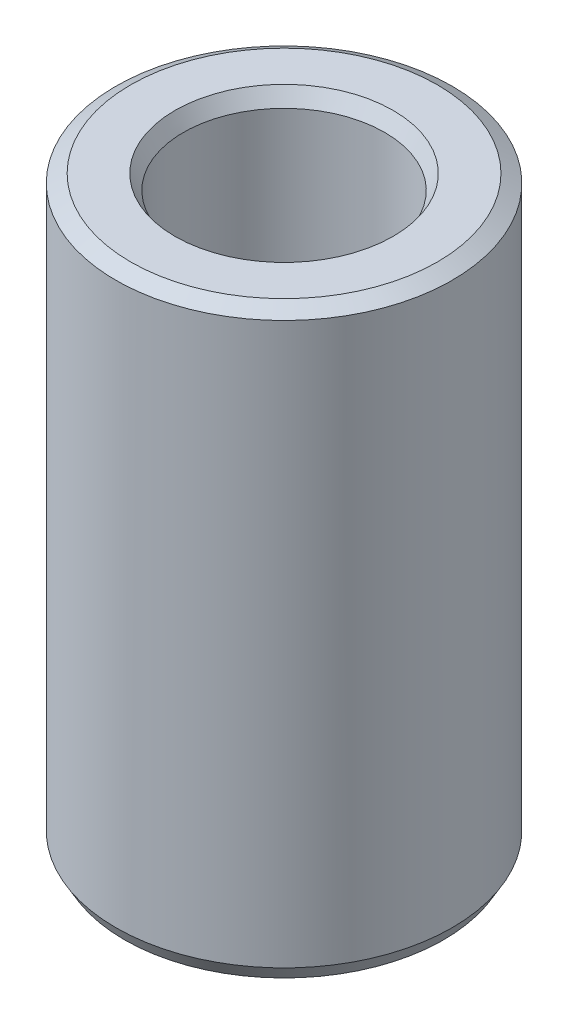
ISO-10303-21;
HEADER;
FILE_DESCRIPTION(('STEP AP214'),'2;1');
FILE_NAME('part.step','',(''),(''),'','','');
FILE_SCHEMA(('AUTOMOTIVE_DESIGN { 1 0 10303 214 1 1 1 1 }'));
ENDSEC;
DATA;
#1=APPLICATION_CONTEXT('core data for automotive mechanical design processes');
#2=APPLICATION_PROTOCOL_DEFINITION('international standard','automotive_design',2000,#1);
#3=PRODUCT_CONTEXT('',#1,'mechanical');
#4=PRODUCT('Part','Part','',(#3));
#5=PRODUCT_RELATED_PRODUCT_CATEGORY('part','',(#4));
#6=PRODUCT_DEFINITION_FORMATION('','',#4);
#7=PRODUCT_DEFINITION_CONTEXT('part definition',#1,'design');
#8=PRODUCT_DEFINITION('design','',#6,#7);
#9=PRODUCT_DEFINITION_SHAPE('','',#8);
#10=(LENGTH_UNIT() NAMED_UNIT(*) SI_UNIT(.MILLI.,.METRE.));
#11=(NAMED_UNIT(*) PLANE_ANGLE_UNIT() SI_UNIT($,.RADIAN.));
#12=(NAMED_UNIT(*) SI_UNIT($,.STERADIAN.) SOLID_ANGLE_UNIT());
#13=UNCERTAINTY_MEASURE_WITH_UNIT(LENGTH_MEASURE(1.E-05),#10,'distance_accuracy_value','');
#14=(GEOMETRIC_REPRESENTATION_CONTEXT(3) GLOBAL_UNCERTAINTY_ASSIGNED_CONTEXT((#13)) GLOBAL_UNIT_ASSIGNED_CONTEXT((#10,
#11,#12)) REPRESENTATION_CONTEXT('',''));
#15=CARTESIAN_POINT('',(0.,0.,0.));
#16=DIRECTION('',(0.,0.,1.));
#17=DIRECTION('',(1.,0.,0.));
#18=AXIS2_PLACEMENT_3D('',#15,#16,#17);
#19=CARTESIAN_POINT('',(0.,182.316415809923,0.));
#20=DIRECTION('',(0.,-1.,0.));
#21=DIRECTION('',(0.,0.,-1.));
#22=AXIS2_PLACEMENT_3D('',#19,#20,#21);
#23=CYLINDRICAL_SURFACE('',#22,52.5);
#24=CARTESIAN_POINT('',(0.,4.60658287398247,0.));
#25=DIRECTION('',(0.,1.,0.));
#26=DIRECTION('',(0.,0.,1.));
#27=AXIS2_PLACEMENT_3D('',#24,#25,#26);
#28=CIRCLE('',#27,52.5);
#29=CARTESIAN_POINT('',(0.,4.60658287398247,-52.5));
#30=VERTEX_POINT('',#29);
#31=EDGE_CURVE('E10',#30,#30,#28,.T.);
#32=CARTESIAN_POINT('',(0.,179.656803947585,0.));
#33=DIRECTION('',(0.,1.,0.));
#34=DIRECTION('',(0.,0.,1.));
#35=AXIS2_PLACEMENT_3D('',#32,#33,#34);
#36=CIRCLE('',#35,52.5);
#37=CARTESIAN_POINT('',(0.,179.656803947585,-52.5));
#38=VERTEX_POINT('',#37);
#39=EDGE_CURVE('E50',#38,#38,#36,.F.);
#40=CARTESIAN_POINT('',(0.,4.60658287398247,-52.5));
#41=CARTESIAN_POINT('',(0.,6.4300226768325,-52.5));
#42=CARTESIAN_POINT('',(0.,8.25346247968252,-52.5));
#43=CARTESIAN_POINT('',(0.,11.9003420853826,-52.5));
#44=CARTESIAN_POINT('',(0.,13.7237818882326,-52.5));
#45=CARTESIAN_POINT('',(0.,17.3706614939327,-52.5));
#46=CARTESIAN_POINT('',(0.,19.1941012967827,-52.5));
#47=CARTESIAN_POINT('',(0.,22.8409809024827,-52.5));
#48=CARTESIAN_POINT('',(0.,24.6644207053327,-52.5));
#49=CARTESIAN_POINT('',(0.,28.3113003110328,-52.5));
#50=CARTESIAN_POINT('',(0.,30.1347401138828,-52.5));
#51=CARTESIAN_POINT('',(0.,33.7816197195829,-52.5));
#52=CARTESIAN_POINT('',(0.,35.6050595224329,-52.5));
#53=CARTESIAN_POINT('',(0.,39.2519391281329,-52.5));
#54=CARTESIAN_POINT('',(0.,41.075378930983,-52.5));
#55=CARTESIAN_POINT('',(0.,44.722258536683,-52.5));
#56=CARTESIAN_POINT('',(0.,46.5456983395331,-52.5));
#57=CARTESIAN_POINT('',(0.,50.1925779452331,-52.5));
#58=CARTESIAN_POINT('',(0.,52.0160177480831,-52.5));
#59=CARTESIAN_POINT('',(0.,55.6628973537832,-52.5));
#60=CARTESIAN_POINT('',(0.,57.4863371566332,-52.5));
#61=CARTESIAN_POINT('',(0.,61.1332167623332,-52.5));
#62=CARTESIAN_POINT('',(0.,62.9566565651833,-52.5));
#63=CARTESIAN_POINT('',(0.,66.6035361708833,-52.5));
#64=CARTESIAN_POINT('',(0.,68.4269759737333,-52.5));
#65=CARTESIAN_POINT('',(0.,72.0738555794334,-52.5));
#66=CARTESIAN_POINT('',(0.,73.8972953822834,-52.5));
#67=CARTESIAN_POINT('',(0.,77.5441749879835,-52.5));
#68=CARTESIAN_POINT('',(0.,79.3676147908335,-52.5));
#69=CARTESIAN_POINT('',(0.,83.0144943965336,-52.5));
#70=CARTESIAN_POINT('',(0.,84.8379341993836,-52.5));
#71=CARTESIAN_POINT('',(0.,88.4848138050836,-52.5));
#72=CARTESIAN_POINT('',(0.,90.3082536079337,-52.5));
#73=CARTESIAN_POINT('',(0.,93.9551332136337,-52.5));
#74=CARTESIAN_POINT('',(0.,95.7785730164837,-52.5));
#75=CARTESIAN_POINT('',(0.,99.4254526221838,-52.5));
#76=CARTESIAN_POINT('',(0.,101.248892425034,-52.5));
#77=CARTESIAN_POINT('',(0.,104.895772030734,-52.5));
#78=CARTESIAN_POINT('',(0.,106.719211833584,-52.5));
#79=CARTESIAN_POINT('',(0.,110.366091439284,-52.5));
#80=CARTESIAN_POINT('',(0.,112.189531242134,-52.5));
#81=CARTESIAN_POINT('',(0.,115.836410847834,-52.5));
#82=CARTESIAN_POINT('',(0.,117.659850650684,-52.5));
#83=CARTESIAN_POINT('',(0.,121.306730256384,-52.5));
#84=CARTESIAN_POINT('',(0.,123.130170059234,-52.5));
#85=CARTESIAN_POINT('',(0.,126.777049664934,-52.5));
#86=CARTESIAN_POINT('',(0.,128.600489467784,-52.5));
#87=CARTESIAN_POINT('',(0.,132.247369073484,-52.5));
#88=CARTESIAN_POINT('',(0.,134.070808876334,-52.5));
#89=CARTESIAN_POINT('',(0.,137.717688482034,-52.5));
#90=CARTESIAN_POINT('',(0.,139.541128284884,-52.5));
#91=CARTESIAN_POINT('',(0.,143.188007890584,-52.5));
#92=CARTESIAN_POINT('',(0.,145.011447693434,-52.5));
#93=CARTESIAN_POINT('',(0.,148.658327299134,-52.5));
#94=CARTESIAN_POINT('',(0.,150.481767101985,-52.5));
#95=CARTESIAN_POINT('',(0.,154.128646707685,-52.5));
#96=CARTESIAN_POINT('',(0.,155.952086510535,-52.5));
#97=CARTESIAN_POINT('',(0.,159.598966116235,-52.5));
#98=CARTESIAN_POINT('',(0.,161.422405919085,-52.5));
#99=CARTESIAN_POINT('',(0.,165.069285524785,-52.5));
#100=CARTESIAN_POINT('',(0.,166.892725327635,-52.5));
#101=CARTESIAN_POINT('',(0.,170.539604933335,-52.5));
#102=CARTESIAN_POINT('',(0.,172.363044736185,-52.5));
#103=CARTESIAN_POINT('',(0.,176.009924341885,-52.5));
#104=CARTESIAN_POINT('',(0.,177.833364144735,-52.5));
#105=CARTESIAN_POINT('',(0.,179.656803947585,-52.5));
#106=B_SPLINE_CURVE_WITH_KNOTS('',3,(#40,#41,#42,#43,#44,#45,#46,#47,#48,#49,#50,#51,#52,#53,
#54,#55,#56,#57,#58,#59,#60,#61,#62,#63,#64,#65,#66,#67,#68,#69,#70,#71,#72,#73,#74,#75,#76,#77,
#78,#79,#80,#81,#82,#83,#84,#85,#86,#87,#88,#89,#90,#91,#92,#93,#94,#95,#96,#97,#98,#99,#100,
#101,#102,#103,#104,#105),.UNSPECIFIED.,.F.,.F.,(4,2,2,2,2,2,2,2,2,2,2,2,2,2,2,2,2,2,2,2,2,2,2,
2,2,2,2,2,2,2,2,2,4),(0.,5.47031940855008,10.9406388171002,16.4109582256502,21.8812776342003,
27.3515970427504,32.8219164513004,38.2922358598505,43.7625552684006,49.2328746769507,
54.7031940855008,60.1735134940508,65.6438329026009,71.114152311151,76.5844717197011,
82.0547911282511,87.5251105368012,92.9954299453513,98.4657493539014,103.936068762451,
109.406388171002,114.876707579552,120.347026988102,125.817346396652,131.287665805202,
136.757985213752,142.228304622302,147.698624030852,153.168943439402,158.639262847952,
164.109582256502,169.579901665052,175.050221073602),.UNSPECIFIED.);
#107=EDGE_CURVE('BSEAM39',#30,#38,#106,.T.);
#108=ORIENTED_EDGE('',*,*,#31,.T.);
#109=ORIENTED_EDGE('',*,*,#39,.T.);
#110=ORIENTED_EDGE('',*,*,#107,.T.);
#111=ORIENTED_EDGE('',*,*,#107,.F.);
#112=EDGE_LOOP('',(#108,#110,#109,#111));
#113=FACE_BOUND('',#112,.T.);
#114=ADVANCED_FACE('F39',(#113),#23,.T.);
#115=CARTESIAN_POINT('',(0.,182.316415809923,0.));
#116=DIRECTION('',(0.,1.,0.));
#117=DIRECTION('',(0.,0.,1.));
#118=AXIS2_PLACEMENT_3D('',#115,#116,#117);
#119=PLANE('',#118);
#120=CARTESIAN_POINT('',(0.,182.316415809923,0.));
#121=DIRECTION('',(0.,1.,0.));
#122=DIRECTION('',(0.,0.,1.));
#123=AXIS2_PLACEMENT_3D('',#120,#121,#122);
#124=CIRCLE('',#123,34.0677595680798);
#125=CARTESIAN_POINT('',(0.,182.316415809923,34.0677595680798));
#126=VERTEX_POINT('',#125);
#127=EDGE_CURVE('E58',#126,#126,#124,.F.);
#128=ORIENTED_EDGE('',*,*,#127,.T.);
#129=EDGE_LOOP('',(#128));
#130=FACE_BOUND('',#129,.T.);
#131=CARTESIAN_POINT('',(0.,182.316415809923,0.));
#132=DIRECTION('',(0.,1.,0.));
#133=DIRECTION('',(0.,0.,1.));
#134=AXIS2_PLACEMENT_3D('',#131,#132,#133);
#135=CIRCLE('',#134,47.8934171260181);
#136=CARTESIAN_POINT('',(0.,182.316415809923,47.8934171260181));
#137=VERTEX_POINT('',#136);
#138=EDGE_CURVE('E61',#137,#137,#135,.T.);
#139=ORIENTED_EDGE('',*,*,#138,.T.);
#140=EDGE_LOOP('',(#139));
#141=FACE_BOUND('',#140,.T.);
#142=ADVANCED_FACE('F88',(#130,#141),#119,.T.);
#143=CARTESIAN_POINT('',(0.,0.,0.));
#144=DIRECTION('',(0.,1.,0.));
#145=DIRECTION('',(0.,0.,1.));
#146=AXIS2_PLACEMENT_3D('',#143,#144,#145);
#147=PLANE('',#146);
#148=CARTESIAN_POINT('',(0.,0.,0.));
#149=DIRECTION('',(0.,1.,0.));
#150=DIRECTION('',(0.,0.,1.));
#151=AXIS2_PLACEMENT_3D('',#148,#149,#150);
#152=CIRCLE('',#151,36.0147305797238);
#153=CARTESIAN_POINT('',(0.,0.,36.0147305797238));
#154=VERTEX_POINT('',#153);
#155=EDGE_CURVE('E51',#154,#154,#152,.T.);
#156=ORIENTED_EDGE('',*,*,#155,.T.);
#157=EDGE_LOOP('',(#156));
#158=FACE_BOUND('',#157,.T.);
#159=CARTESIAN_POINT('',(0.,0.,0.));
#160=DIRECTION('',(0.,1.,0.));
#161=DIRECTION('',(0.,0.,1.));
#162=AXIS2_PLACEMENT_3D('',#159,#160,#161);
#163=CIRCLE('',#162,49.8403881376619);
#164=CARTESIAN_POINT('',(0.,0.,49.8403881376619));
#165=VERTEX_POINT('',#164);
#166=EDGE_CURVE('E54',#165,#165,#163,.F.);
#167=ORIENTED_EDGE('',*,*,#166,.T.);
#168=EDGE_LOOP('',(#167));
#169=FACE_BOUND('',#168,.T.);
#170=ADVANCED_FACE('F83',(#158,#169),#147,.F.);
#171=CARTESIAN_POINT('',(0.,182.316415809923,0.));
#172=DIRECTION('',(0.,-1.,0.));
#173=DIRECTION('',(0.,0.,-1.));
#174=AXIS2_PLACEMENT_3D('',#171,#172,#173);
#175=CYLINDRICAL_SURFACE('',#174,31.4081477057419);
#176=CARTESIAN_POINT('',(0.,177.709832935941,0.));
#177=DIRECTION('',(0.,1.,0.));
#178=DIRECTION('',(0.,0.,1.));
#179=AXIS2_PLACEMENT_3D('',#176,#177,#178);
#180=CIRCLE('',#179,31.4081477057419);
#181=CARTESIAN_POINT('',(0.,177.709832935941,-31.4081477057419));
#182=VERTEX_POINT('',#181);
#183=EDGE_CURVE('E67',#182,#182,#180,.T.);
#184=CARTESIAN_POINT('',(0.,2.65961186233782,0.));
#185=DIRECTION('',(0.,1.,0.));
#186=DIRECTION('',(0.,0.,1.));
#187=AXIS2_PLACEMENT_3D('',#184,#185,#186);
#188=CIRCLE('',#187,31.4081477057419);
#189=CARTESIAN_POINT('',(0.,2.65961186233782,-31.4081477057419));
#190=VERTEX_POINT('',#189);
#191=EDGE_CURVE('E69',#190,#190,#188,.F.);
#192=CARTESIAN_POINT('',(0.,177.709832935941,-31.4081477057419));
#193=CARTESIAN_POINT('',(0.,175.886393133091,-31.4081477057419));
#194=CARTESIAN_POINT('',(0.,174.062953330241,-31.4081477057419));
#195=CARTESIAN_POINT('',(0.,170.41607372454,-31.4081477057419));
#196=CARTESIAN_POINT('',(0.,168.59263392169,-31.4081477057419));
#197=CARTESIAN_POINT('',(0.,164.94575431599,-31.4081477057419));
#198=CARTESIAN_POINT('',(0.,163.12231451314,-31.4081477057419));
#199=CARTESIAN_POINT('',(0.,159.47543490744,-31.4081477057419));
#200=CARTESIAN_POINT('',(0.,157.65199510459,-31.4081477057419));
#201=CARTESIAN_POINT('',(0.,154.00511549889,-31.4081477057419));
#202=CARTESIAN_POINT('',(0.,152.18167569604,-31.4081477057419));
#203=CARTESIAN_POINT('',(0.,148.53479609034,-31.4081477057419));
#204=CARTESIAN_POINT('',(0.,146.71135628749,-31.4081477057419));
#205=CARTESIAN_POINT('',(0.,143.06447668179,-31.4081477057419));
#206=CARTESIAN_POINT('',(0.,141.24103687894,-31.4081477057419));
#207=CARTESIAN_POINT('',(0.,137.59415727324,-31.4081477057419));
#208=CARTESIAN_POINT('',(0.,135.77071747039,-31.4081477057419));
#209=CARTESIAN_POINT('',(0.,132.12383786469,-31.4081477057419));
#210=CARTESIAN_POINT('',(0.,130.30039806184,-31.4081477057419));
#211=CARTESIAN_POINT('',(0.,126.65351845614,-31.4081477057419));
#212=CARTESIAN_POINT('',(0.,124.83007865329,-31.4081477057419));
#213=CARTESIAN_POINT('',(0.,121.18319904759,-31.4081477057419));
#214=CARTESIAN_POINT('',(0.,119.35975924474,-31.4081477057419));
#215=CARTESIAN_POINT('',(0.,115.71287963904,-31.4081477057419));
#216=CARTESIAN_POINT('',(0.,113.88943983619,-31.4081477057419));
#217=CARTESIAN_POINT('',(0.,110.24256023049,-31.4081477057419));
#218=CARTESIAN_POINT('',(0.,108.419120427639,-31.4081477057419));
#219=CARTESIAN_POINT('',(0.,104.772240821939,-31.4081477057419));
#220=CARTESIAN_POINT('',(0.,102.948801019089,-31.4081477057419));
#221=CARTESIAN_POINT('',(0.,99.3019214133893,-31.4081477057419));
#222=CARTESIAN_POINT('',(0.,97.4784816105393,-31.4081477057419));
#223=CARTESIAN_POINT('',(0.,93.8316020048392,-31.4081477057419));
#224=CARTESIAN_POINT('',(0.,92.0081622019892,-31.4081477057419));
#225=CARTESIAN_POINT('',(0.,88.3612825962892,-31.4081477057419));
#226=CARTESIAN_POINT('',(0.,86.5378427934391,-31.4081477057419));
#227=CARTESIAN_POINT('',(0.,82.8909631877391,-31.4081477057419));
#228=CARTESIAN_POINT('',(0.,81.0675233848891,-31.4081477057419));
#229=CARTESIAN_POINT('',(0.,77.420643779189,-31.4081477057419));
#230=CARTESIAN_POINT('',(0.,75.597203976339,-31.4081477057419));
#231=CARTESIAN_POINT('',(0.,71.9503243706389,-31.4081477057419));
#232=CARTESIAN_POINT('',(0.,70.1268845677889,-31.4081477057419));
#233=CARTESIAN_POINT('',(0.,66.4800049620888,-31.4081477057419));
#234=CARTESIAN_POINT('',(0.,64.6565651592388,-31.4081477057419));
#235=CARTESIAN_POINT('',(0.,61.0096855535387,-31.4081477057419));
#236=CARTESIAN_POINT('',(0.,59.1862457506887,-31.4081477057419));
#237=CARTESIAN_POINT('',(0.,55.5393661449886,-31.4081477057419));
#238=CARTESIAN_POINT('',(0.,53.7159263421386,-31.4081477057419));
#239=CARTESIAN_POINT('',(0.,50.0690467364386,-31.4081477057419));
#240=CARTESIAN_POINT('',(0.,48.2456069335885,-31.4081477057419));
#241=CARTESIAN_POINT('',(0.,44.5987273278885,-31.4081477057419));
#242=CARTESIAN_POINT('',(0.,42.7752875250384,-31.4081477057419));
#243=CARTESIAN_POINT('',(0.,39.1284079193384,-31.4081477057419));
#244=CARTESIAN_POINT('',(0.,37.3049681164883,-31.4081477057419));
#245=CARTESIAN_POINT('',(0.,33.6580885107883,-31.4081477057419));
#246=CARTESIAN_POINT('',(0.,31.8346487079383,-31.4081477057419));
#247=CARTESIAN_POINT('',(0.,28.1877691022382,-31.4081477057419));
#248=CARTESIAN_POINT('',(0.,26.3643292993882,-31.4081477057419));
#249=CARTESIAN_POINT('',(0.,22.7174496936881,-31.4081477057419));
#250=CARTESIAN_POINT('',(0.,20.8940098908381,-31.4081477057419));
#251=CARTESIAN_POINT('',(0.,17.247130285138,-31.4081477057419));
#252=CARTESIAN_POINT('',(0.,15.423690482288,-31.4081477057419));
#253=CARTESIAN_POINT('',(0.,11.776810876588,-31.4081477057419));
#254=CARTESIAN_POINT('',(0.,9.95337107373793,-31.4081477057419));
#255=CARTESIAN_POINT('',(0.,6.30649146803787,-31.4081477057419));
#256=CARTESIAN_POINT('',(0.,4.48305166518785,-31.4081477057419));
#257=CARTESIAN_POINT('',(0.,2.65961186233782,-31.4081477057419));
#258=B_SPLINE_CURVE_WITH_KNOTS('',3,(#192,#193,#194,#195,#196,#197,#198,#199,#200,#201,#202,
#203,#204,#205,#206,#207,#208,#209,#210,#211,#212,#213,#214,#215,#216,#217,#218,#219,#220,#221,
#222,#223,#224,#225,#226,#227,#228,#229,#230,#231,#232,#233,#234,#235,#236,#237,#238,#239,#240,
#241,#242,#243,#244,#245,#246,#247,#248,#249,#250,#251,#252,#253,#254,#255,#256,#257),
.UNSPECIFIED.,.F.,.F.,(4,2,2,2,2,2,2,2,2,2,2,2,2,2,2,2,2,2,2,2,2,2,2,2,2,2,2,2,2,2,2,2,4),(0.,
5.47031940855011,10.9406388171002,16.4109582256503,21.8812776342004,27.3515970427504,
32.8219164513005,38.2922358598506,43.7625552684007,49.2328746769508,54.7031940855009,
60.173513494051,65.643832902601,71.1141523111511,76.5844717197012,82.0547911282513,
87.5251105368014,92.9954299453515,98.4657493539016,103.936068762452,109.406388171002,
114.876707579552,120.347026988102,125.817346396652,131.287665805202,136.757985213752,
142.228304622302,147.698624030852,153.168943439402,158.639262847953,164.109582256503,
169.579901665053,175.050221073603),.UNSPECIFIED.);
#259=EDGE_CURVE('BSEAM71',#182,#190,#258,.T.);
#260=ORIENTED_EDGE('',*,*,#183,.T.);
#261=ORIENTED_EDGE('',*,*,#191,.T.);
#262=ORIENTED_EDGE('',*,*,#259,.T.);
#263=ORIENTED_EDGE('',*,*,#259,.F.);
#264=EDGE_LOOP('',(#260,#262,#261,#263));
#265=FACE_BOUND('',#264,.T.);
#266=ADVANCED_FACE('F71',(#265),#175,.F.);
#267=CARTESIAN_POINT('',(0.,177.709832935941,0.));
#268=DIRECTION('',(0.,1.,0.));
#269=DIRECTION('',(0.,0.,1.));
#270=AXIS2_PLACEMENT_3D('',#267,#268,#269);
#271=CONICAL_SURFACE('',#270,31.4081477057419,0.523598775598301);
#272=ORIENTED_EDGE('',*,*,#127,.F.);
#273=EDGE_LOOP('',(#272));
#274=FACE_BOUND('',#273,.T.);
#275=ORIENTED_EDGE('',*,*,#183,.F.);
#276=EDGE_LOOP('',(#275));
#277=FACE_BOUND('',#276,.T.);
#278=ADVANCED_FACE('F77',(#274,#277),#271,.F.);
#279=CARTESIAN_POINT('',(0.,0.,0.));
#280=DIRECTION('',(0.,-1.,0.));
#281=DIRECTION('',(0.,0.,-1.));
#282=AXIS2_PLACEMENT_3D('',#279,#280,#281);
#283=CONICAL_SURFACE('',#282,36.0147305797238,1.04719755119659);
#284=ORIENTED_EDGE('',*,*,#191,.F.);
#285=EDGE_LOOP('',(#284));
#286=FACE_BOUND('',#285,.T.);
#287=ORIENTED_EDGE('',*,*,#155,.F.);
#288=EDGE_LOOP('',(#287));
#289=FACE_BOUND('',#288,.T.);
#290=ADVANCED_FACE('F73',(#286,#289),#283,.F.);
#291=CARTESIAN_POINT('',(0.,4.60658287398247,0.));
#292=DIRECTION('',(0.,1.,0.));
#293=DIRECTION('',(0.,0.,1.));
#294=AXIS2_PLACEMENT_3D('',#291,#292,#293);
#295=CONICAL_SURFACE('',#294,52.5,0.523598775598302);
#296=ORIENTED_EDGE('',*,*,#166,.F.);
#297=EDGE_LOOP('',(#296));
#298=FACE_BOUND('',#297,.T.);
#299=ORIENTED_EDGE('',*,*,#31,.F.);
#300=EDGE_LOOP('',(#299));
#301=FACE_BOUND('',#300,.T.);
#302=ADVANCED_FACE('F76',(#298,#301),#295,.T.);
#303=CARTESIAN_POINT('',(0.,182.316415809923,0.));
#304=DIRECTION('',(0.,-1.,0.));
#305=DIRECTION('',(0.,0.,-1.));
#306=AXIS2_PLACEMENT_3D('',#303,#304,#305);
#307=CONICAL_SURFACE('',#306,47.8934171260181,1.04719755119659);
#308=ORIENTED_EDGE('',*,*,#39,.F.);
#309=EDGE_LOOP('',(#308));
#310=FACE_BOUND('',#309,.T.);
#311=ORIENTED_EDGE('',*,*,#138,.F.);
#312=EDGE_LOOP('',(#311));
#313=FACE_BOUND('',#312,.T.);
#314=ADVANCED_FACE('F45',(#310,#313),#307,.T.);
#315=CLOSED_SHELL('',(#114,#142,#170,#266,#278,#290,#302,#314));
#316=MANIFOLD_SOLID_BREP('B2',#315);
#317=ADVANCED_BREP_SHAPE_REPRESENTATION('',(#18,#316),#14);
#318=SHAPE_DEFINITION_REPRESENTATION(#9,#317);
ENDSEC;
END-ISO-10303-21;
